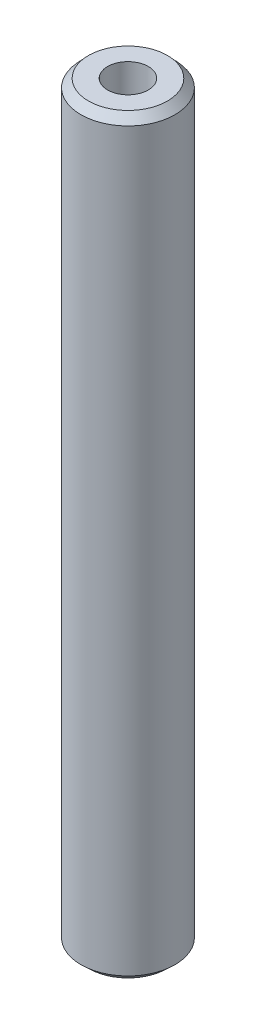
ISO-10303-21;
HEADER;
FILE_DESCRIPTION(('STEP AP214'),'2;1');
FILE_NAME('part.step','',(''),(''),'','','');
FILE_SCHEMA(('AUTOMOTIVE_DESIGN { 1 0 10303 214 1 1 1 1 }'));
ENDSEC;
DATA;
#1=APPLICATION_CONTEXT('core data for automotive mechanical design processes');
#2=APPLICATION_PROTOCOL_DEFINITION('international standard','automotive_design',2000,#1);
#3=PRODUCT_CONTEXT('',#1,'mechanical');
#4=PRODUCT('Part','Part','',(#3));
#5=PRODUCT_RELATED_PRODUCT_CATEGORY('part','',(#4));
#6=PRODUCT_DEFINITION_FORMATION('','',#4);
#7=PRODUCT_DEFINITION_CONTEXT('part definition',#1,'design');
#8=PRODUCT_DEFINITION('design','',#6,#7);
#9=PRODUCT_DEFINITION_SHAPE('','',#8);
#10=(LENGTH_UNIT() NAMED_UNIT(*) SI_UNIT(.MILLI.,.METRE.));
#11=(NAMED_UNIT(*) PLANE_ANGLE_UNIT() SI_UNIT($,.RADIAN.));
#12=(NAMED_UNIT(*) SI_UNIT($,.STERADIAN.) SOLID_ANGLE_UNIT());
#13=UNCERTAINTY_MEASURE_WITH_UNIT(LENGTH_MEASURE(1.E-05),#10,'distance_accuracy_value','');
#14=(GEOMETRIC_REPRESENTATION_CONTEXT(3) GLOBAL_UNCERTAINTY_ASSIGNED_CONTEXT((#13)) GLOBAL_UNIT_ASSIGNED_CONTEXT((#10,
#11,#12)) REPRESENTATION_CONTEXT('',''));
#15=CARTESIAN_POINT('',(0.,0.,0.));
#16=DIRECTION('',(0.,0.,1.));
#17=DIRECTION('',(1.,0.,0.));
#18=AXIS2_PLACEMENT_3D('',#15,#16,#17);
#19=CARTESIAN_POINT('',(0.,159.96838125971,0.));
#20=DIRECTION('',(0.,-1.,0.));
#21=DIRECTION('',(0.,0.,-1.));
#22=AXIS2_PLACEMENT_3D('',#19,#20,#21);
#23=CYLINDRICAL_SURFACE('',#22,10.);
#24=CARTESIAN_POINT('',(0.,158.24003330511,0.));
#25=DIRECTION('',(0.,1.,0.));
#26=DIRECTION('',(0.,0.,1.));
#27=AXIS2_PLACEMENT_3D('',#24,#25,#26);
#28=CIRCLE('',#27,10.);
#29=CARTESIAN_POINT('',(0.,158.24003330511,10.));
#30=VERTEX_POINT('',#29);
#31=EDGE_CURVE('E50',#30,#30,#28,.F.);
#32=ORIENTED_EDGE('',*,*,#31,.T.);
#33=EDGE_LOOP('',(#32));
#34=FACE_BOUND('',#33,.T.);
#35=CARTESIAN_POINT('',(0.,1.59681733059178,0.));
#36=DIRECTION('',(0.,1.,0.));
#37=DIRECTION('',(0.,0.,1.));
#38=AXIS2_PLACEMENT_3D('',#35,#36,#37);
#39=CIRCLE('',#38,10.);
#40=CARTESIAN_POINT('',(0.,1.59681733059178,10.));
#41=VERTEX_POINT('',#40);
#42=EDGE_CURVE('E51',#41,#41,#39,.T.);
#43=ORIENTED_EDGE('',*,*,#42,.T.);
#44=EDGE_LOOP('',(#43));
#45=FACE_BOUND('',#44,.T.);
#46=ADVANCED_FACE('F39',(#34,#45),#23,.T.);
#47=CARTESIAN_POINT('',(0.,159.96838125971,0.));
#48=DIRECTION('',(0.,1.,0.));
#49=DIRECTION('',(0.,0.,1.));
#50=AXIS2_PLACEMENT_3D('',#47,#48,#49);
#51=PLANE('',#50);
#52=CARTESIAN_POINT('',(0.,159.96838125971,0.));
#53=DIRECTION('',(0.,1.,0.));
#54=DIRECTION('',(0.,0.,1.));
#55=AXIS2_PLACEMENT_3D('',#52,#53,#54);
#56=CIRCLE('',#55,8.40318266940825);
#57=CARTESIAN_POINT('',(0.,159.96838125971,8.40318266940825));
#58=VERTEX_POINT('',#57);
#59=EDGE_CURVE('E54',#58,#58,#56,.T.);
#60=ORIENTED_EDGE('',*,*,#59,.T.);
#61=EDGE_LOOP('',(#60));
#62=FACE_BOUND('',#61,.T.);
#63=CARTESIAN_POINT('',(0.,159.96838125971,0.));
#64=DIRECTION('',(0.,1.,0.));
#65=DIRECTION('',(0.,0.,1.));
#66=AXIS2_PLACEMENT_3D('',#63,#64,#65);
#67=CIRCLE('',#66,4.33368371184874);
#68=CARTESIAN_POINT('',(0.,159.96838125971,4.33368371184874));
#69=VERTEX_POINT('',#68);
#70=EDGE_CURVE('E58',#69,#69,#67,.T.);
#71=ORIENTED_EDGE('',*,*,#70,.F.);
#72=EDGE_LOOP('',(#71));
#73=FACE_BOUND('',#72,.T.);
#74=ADVANCED_FACE('F69',(#62,#73),#51,.T.);
#75=CARTESIAN_POINT('',(0.,0.,0.));
#76=DIRECTION('',(0.,1.,0.));
#77=DIRECTION('',(0.,0.,1.));
#78=AXIS2_PLACEMENT_3D('',#75,#76,#77);
#79=PLANE('',#78);
#80=CARTESIAN_POINT('',(0.,0.,0.));
#81=DIRECTION('',(0.,1.,0.));
#82=DIRECTION('',(0.,0.,1.));
#83=AXIS2_PLACEMENT_3D('',#80,#81,#82);
#84=CIRCLE('',#83,8.27165204539941);
#85=CARTESIAN_POINT('',(0.,0.,8.27165204539941));
#86=VERTEX_POINT('',#85);
#87=EDGE_CURVE('E10',#86,#86,#84,.F.);
#88=ORIENTED_EDGE('',*,*,#87,.T.);
#89=EDGE_LOOP('',(#88));
#90=FACE_BOUND('',#89,.T.);
#91=CARTESIAN_POINT('',(0.,0.,0.));
#92=DIRECTION('',(0.,1.,0.));
#93=DIRECTION('',(0.,0.,1.));
#94=AXIS2_PLACEMENT_3D('',#91,#92,#93);
#95=CIRCLE('',#94,4.33368371184874);
#96=CARTESIAN_POINT('',(0.,0.,4.33368371184874));
#97=VERTEX_POINT('',#96);
#98=EDGE_CURVE('E63',#97,#97,#95,.T.);
#99=ORIENTED_EDGE('',*,*,#98,.T.);
#100=EDGE_LOOP('',(#99));
#101=FACE_BOUND('',#100,.T.);
#102=ADVANCED_FACE('F75',(#90,#101),#79,.F.);
#103=CARTESIAN_POINT('',(0.,159.96838125971,0.));
#104=DIRECTION('',(0.,-1.,0.));
#105=DIRECTION('',(0.,0.,-1.));
#106=AXIS2_PLACEMENT_3D('',#103,#104,#105);
#107=CYLINDRICAL_SURFACE('',#106,4.33368371184874);
#108=ORIENTED_EDGE('',*,*,#70,.T.);
#109=EDGE_LOOP('',(#108));
#110=FACE_BOUND('',#109,.T.);
#111=ORIENTED_EDGE('',*,*,#98,.F.);
#112=EDGE_LOOP('',(#111));
#113=FACE_BOUND('',#112,.T.);
#114=ADVANCED_FACE('F70',(#110,#113),#107,.F.);
#115=CARTESIAN_POINT('',(0.,159.96838125971,0.));
#116=DIRECTION('',(0.,-1.,0.));
#117=DIRECTION('',(0.,0.,-1.));
#118=AXIS2_PLACEMENT_3D('',#115,#116,#117);
#119=CONICAL_SURFACE('',#118,8.40318266940825,0.745862658940938);
#120=ORIENTED_EDGE('',*,*,#31,.F.);
#121=EDGE_LOOP('',(#120));
#122=FACE_BOUND('',#121,.T.);
#123=ORIENTED_EDGE('',*,*,#59,.F.);
#124=EDGE_LOOP('',(#123));
#125=FACE_BOUND('',#124,.T.);
#126=ADVANCED_FACE('F81',(#122,#125),#119,.T.);
#127=CARTESIAN_POINT('',(0.,1.59681733059178,0.));
#128=DIRECTION('',(0.,1.,0.));
#129=DIRECTION('',(0.,0.,1.));
#130=AXIS2_PLACEMENT_3D('',#127,#128,#129);
#131=CONICAL_SURFACE('',#130,10.,0.824933667853969);
#132=ORIENTED_EDGE('',*,*,#87,.F.);
#133=EDGE_LOOP('',(#132));
#134=FACE_BOUND('',#133,.T.);
#135=ORIENTED_EDGE('',*,*,#42,.F.);
#136=EDGE_LOOP('',(#135));
#137=FACE_BOUND('',#136,.T.);
#138=ADVANCED_FACE('F45',(#134,#137),#131,.T.);
#139=CLOSED_SHELL('',(#46,#74,#102,#114,#126,#138));
#140=MANIFOLD_SOLID_BREP('B2',#139);
#141=ADVANCED_BREP_SHAPE_REPRESENTATION('',(#18,#140),#14);
#142=SHAPE_DEFINITION_REPRESENTATION(#9,#141);
ENDSEC;
END-ISO-10303-21;
